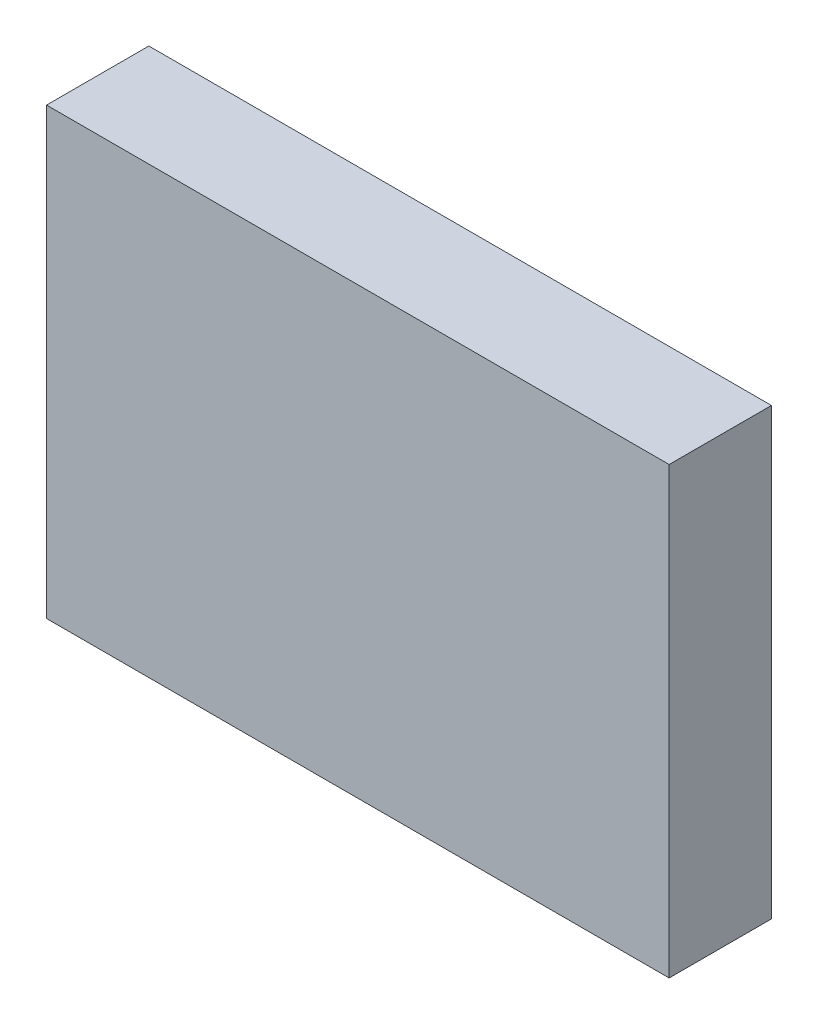
ISO-10303-21;
HEADER;
FILE_DESCRIPTION(('STEP AP214'),'2;1');
FILE_NAME('part.step','',(''),(''),'','','');
FILE_SCHEMA(('AUTOMOTIVE_DESIGN { 1 0 10303 214 1 1 1 1 }'));
ENDSEC;
DATA;
#1=APPLICATION_CONTEXT('core data for automotive mechanical design processes');
#2=APPLICATION_PROTOCOL_DEFINITION('international standard','automotive_design',2000,#1);
#3=PRODUCT_CONTEXT('',#1,'mechanical');
#4=PRODUCT('Part','Part','',(#3));
#5=PRODUCT_RELATED_PRODUCT_CATEGORY('part','',(#4));
#6=PRODUCT_DEFINITION_FORMATION('','',#4);
#7=PRODUCT_DEFINITION_CONTEXT('part definition',#1,'design');
#8=PRODUCT_DEFINITION('design','',#6,#7);
#9=PRODUCT_DEFINITION_SHAPE('','',#8);
#10=(LENGTH_UNIT() NAMED_UNIT(*) SI_UNIT(.MILLI.,.METRE.));
#11=(NAMED_UNIT(*) PLANE_ANGLE_UNIT() SI_UNIT($,.RADIAN.));
#12=(NAMED_UNIT(*) SI_UNIT($,.STERADIAN.) SOLID_ANGLE_UNIT());
#13=UNCERTAINTY_MEASURE_WITH_UNIT(LENGTH_MEASURE(1.E-05),#10,'distance_accuracy_value','');
#14=(GEOMETRIC_REPRESENTATION_CONTEXT(3) GLOBAL_UNCERTAINTY_ASSIGNED_CONTEXT((#13)) GLOBAL_UNIT_ASSIGNED_CONTEXT((#10,
#11,#12)) REPRESENTATION_CONTEXT('',''));
#15=CARTESIAN_POINT('',(0.,0.,0.));
#16=DIRECTION('',(0.,0.,1.));
#17=DIRECTION('',(1.,0.,0.));
#18=AXIS2_PLACEMENT_3D('',#15,#16,#17);
#19=CARTESIAN_POINT('',(36.4459935769135,29.6252967338106,2.3));
#20=DIRECTION('',(1.,0.,0.));
#21=DIRECTION('',(0.,0.,-1.));
#22=AXIS2_PLACEMENT_3D('',#19,#20,#21);
#23=PLANE('',#22);
#24=DIRECTION('',(0.,-1.,0.));
#25=VECTOR('',#24,1.);
#26=CARTESIAN_POINT('',(36.4459935769135,29.6252967338106,0.));
#27=LINE('',#26,#25);
#28=CARTESIAN_POINT('',(36.4459935769135,29.6252967338106,0.));
#29=VERTEX_POINT('',#28);
#30=CARTESIAN_POINT('',(36.4459935769135,19.6252967338106,0.));
#31=VERTEX_POINT('',#30);
#32=EDGE_CURVE('E100',#29,#31,#27,.T.);
#33=ORIENTED_EDGE('',*,*,#32,.T.);
#34=DIRECTION('',(0.,0.,-1.));
#35=VECTOR('',#34,1.);
#36=CARTESIAN_POINT('',(36.4459935769135,19.6252967338106,2.3));
#37=LINE('',#36,#35);
#38=CARTESIAN_POINT('',(36.4459935769135,19.6252967338106,2.3));
#39=VERTEX_POINT('',#38);
#40=EDGE_CURVE('E11',#39,#31,#37,.T.);
#41=ORIENTED_EDGE('',*,*,#40,.F.);
#42=DIRECTION('',(0.,-1.,0.));
#43=VECTOR('',#42,1.);
#44=CARTESIAN_POINT('',(36.4459935769135,29.6252967338106,2.3));
#45=LINE('',#44,#43);
#46=CARTESIAN_POINT('',(36.4459935769135,29.6252967338106,2.3));
#47=VERTEX_POINT('',#46);
#48=EDGE_CURVE('E88',#47,#39,#45,.T.);
#49=ORIENTED_EDGE('',*,*,#48,.F.);
#50=DIRECTION('',(0.,0.,-1.));
#51=VECTOR('',#50,1.);
#52=CARTESIAN_POINT('',(36.4459935769135,29.6252967338106,2.3));
#53=LINE('',#52,#51);
#54=EDGE_CURVE('E96',#47,#29,#53,.T.);
#55=ORIENTED_EDGE('',*,*,#54,.T.);
#56=EDGE_LOOP('',(#33,#41,#49,#55));
#57=FACE_BOUND('',#56,.T.);
#58=ADVANCED_FACE('F37',(#57),#23,.F.);
#59=CARTESIAN_POINT('',(36.4459935769135,19.6252967338106,2.3));
#60=DIRECTION('',(0.,1.,0.));
#61=DIRECTION('',(-1.,0.,0.));
#62=AXIS2_PLACEMENT_3D('',#59,#60,#61);
#63=PLANE('',#62);
#64=DIRECTION('',(1.,0.,0.));
#65=VECTOR('',#64,1.);
#66=CARTESIAN_POINT('',(36.4459935769135,19.6252967338106,0.));
#67=LINE('',#66,#65);
#68=CARTESIAN_POINT('',(50.4459935769135,19.6252967338106,0.));
#69=VERTEX_POINT('',#68);
#70=EDGE_CURVE('E92',#31,#69,#67,.T.);
#71=ORIENTED_EDGE('',*,*,#70,.T.);
#72=DIRECTION('',(0.,0.,-1.));
#73=VECTOR('',#72,1.);
#74=CARTESIAN_POINT('',(50.4459935769135,19.6252967338106,2.3));
#75=LINE('',#74,#73);
#76=CARTESIAN_POINT('',(50.4459935769135,19.6252967338106,2.3));
#77=VERTEX_POINT('',#76);
#78=EDGE_CURVE('E45',#77,#69,#75,.T.);
#79=ORIENTED_EDGE('',*,*,#78,.F.);
#80=DIRECTION('',(1.,0.,0.));
#81=VECTOR('',#80,1.);
#82=CARTESIAN_POINT('',(36.4459935769135,19.6252967338106,2.3));
#83=LINE('',#82,#81);
#84=EDGE_CURVE('E83',#39,#77,#83,.T.);
#85=ORIENTED_EDGE('',*,*,#84,.F.);
#86=ORIENTED_EDGE('',*,*,#40,.T.);
#87=EDGE_LOOP('',(#71,#79,#85,#86));
#88=FACE_BOUND('',#87,.T.);
#89=ADVANCED_FACE('F91',(#88),#63,.F.);
#90=CARTESIAN_POINT('',(50.4459935769135,29.6252967338106,2.3));
#91=DIRECTION('',(-1.,0.,0.));
#92=DIRECTION('',(0.,-1.,0.));
#93=AXIS2_PLACEMENT_3D('',#90,#91,#92);
#94=PLANE('',#93);
#95=DIRECTION('',(0.,1.,0.));
#96=VECTOR('',#95,1.);
#97=CARTESIAN_POINT('',(50.4459935769135,29.6252967338106,0.));
#98=LINE('',#97,#96);
#99=CARTESIAN_POINT('',(50.4459935769135,29.6252967338106,0.));
#100=VERTEX_POINT('',#99);
#101=EDGE_CURVE('E70',#69,#100,#98,.T.);
#102=ORIENTED_EDGE('',*,*,#101,.T.);
#103=DIRECTION('',(0.,0.,-1.));
#104=VECTOR('',#103,1.);
#105=CARTESIAN_POINT('',(50.4459935769135,29.6252967338106,2.3));
#106=LINE('',#105,#104);
#107=CARTESIAN_POINT('',(50.4459935769135,29.6252967338106,2.3));
#108=VERTEX_POINT('',#107);
#109=EDGE_CURVE('E93',#108,#100,#106,.T.);
#110=ORIENTED_EDGE('',*,*,#109,.F.);
#111=DIRECTION('',(0.,1.,0.));
#112=VECTOR('',#111,1.);
#113=CARTESIAN_POINT('',(50.4459935769135,29.6252967338106,2.3));
#114=LINE('',#113,#112);
#115=EDGE_CURVE('E86',#77,#108,#114,.T.);
#116=ORIENTED_EDGE('',*,*,#115,.F.);
#117=ORIENTED_EDGE('',*,*,#78,.T.);
#118=EDGE_LOOP('',(#102,#110,#116,#117));
#119=FACE_BOUND('',#118,.T.);
#120=ADVANCED_FACE('F94',(#119),#94,.F.);
#121=CARTESIAN_POINT('',(36.4459935769135,29.6252967338106,2.3));
#122=DIRECTION('',(0.,-1.,0.));
#123=DIRECTION('',(1.,0.,0.));
#124=AXIS2_PLACEMENT_3D('',#121,#122,#123);
#125=PLANE('',#124);
#126=DIRECTION('',(-1.,0.,0.));
#127=VECTOR('',#126,1.);
#128=CARTESIAN_POINT('',(36.4459935769135,29.6252967338106,0.));
#129=LINE('',#128,#127);
#130=EDGE_CURVE('E76',#100,#29,#129,.T.);
#131=ORIENTED_EDGE('',*,*,#130,.T.);
#132=ORIENTED_EDGE('',*,*,#54,.F.);
#133=DIRECTION('',(-1.,0.,0.));
#134=VECTOR('',#133,1.);
#135=CARTESIAN_POINT('',(36.4459935769135,29.6252967338106,2.3));
#136=LINE('',#135,#134);
#137=EDGE_CURVE('E53',#108,#47,#136,.T.);
#138=ORIENTED_EDGE('',*,*,#137,.F.);
#139=ORIENTED_EDGE('',*,*,#109,.T.);
#140=EDGE_LOOP('',(#131,#132,#138,#139));
#141=FACE_BOUND('',#140,.T.);
#142=ADVANCED_FACE('F107',(#141),#125,.F.);
#143=CARTESIAN_POINT('',(0.,0.,2.3));
#144=DIRECTION('',(0.,0.,1.));
#145=DIRECTION('',(1.,0.,0.));
#146=AXIS2_PLACEMENT_3D('',#143,#144,#145);
#147=PLANE('',#146);
#148=ORIENTED_EDGE('',*,*,#48,.T.);
#149=ORIENTED_EDGE('',*,*,#84,.T.);
#150=ORIENTED_EDGE('',*,*,#115,.T.);
#151=ORIENTED_EDGE('',*,*,#137,.T.);
#152=EDGE_LOOP('',(#148,#149,#150,#151));
#153=FACE_BOUND('',#152,.T.);
#154=ADVANCED_FACE('F84',(#153),#147,.T.);
#155=CARTESIAN_POINT('',(0.,0.,0.));
#156=DIRECTION('',(0.,0.,1.));
#157=DIRECTION('',(1.,0.,0.));
#158=AXIS2_PLACEMENT_3D('',#155,#156,#157);
#159=PLANE('',#158);
#160=ORIENTED_EDGE('',*,*,#32,.F.);
#161=ORIENTED_EDGE('',*,*,#130,.F.);
#162=ORIENTED_EDGE('',*,*,#101,.F.);
#163=ORIENTED_EDGE('',*,*,#70,.F.);
#164=EDGE_LOOP('',(#160,#161,#162,#163));
#165=FACE_BOUND('',#164,.T.);
#166=ADVANCED_FACE('F110',(#165),#159,.F.);
#167=CLOSED_SHELL('',(#58,#89,#120,#142,#154,#166));
#168=MANIFOLD_SOLID_BREP('B2',#167);
#169=ADVANCED_BREP_SHAPE_REPRESENTATION('',(#18,#168),#14);
#170=SHAPE_DEFINITION_REPRESENTATION(#9,#169);
ENDSEC;
END-ISO-10303-21;
